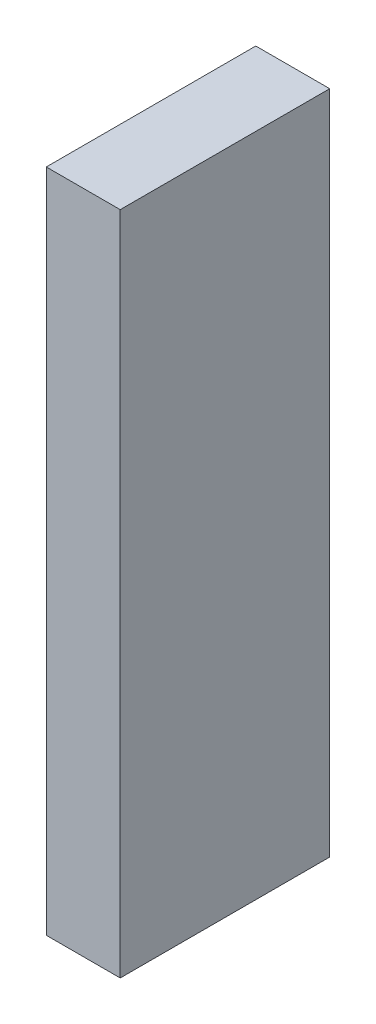
ISO-10303-21;
HEADER;
FILE_DESCRIPTION(('STEP AP214'),'2;1');
FILE_NAME('part.step','',(''),(''),'','','');
FILE_SCHEMA(('AUTOMOTIVE_DESIGN { 1 0 10303 214 1 1 1 1 }'));
ENDSEC;
DATA;
#1=APPLICATION_CONTEXT('core data for automotive mechanical design processes');
#2=APPLICATION_PROTOCOL_DEFINITION('international standard','automotive_design',2000,#1);
#3=PRODUCT_CONTEXT('',#1,'mechanical');
#4=PRODUCT('Part','Part','',(#3));
#5=PRODUCT_RELATED_PRODUCT_CATEGORY('part','',(#4));
#6=PRODUCT_DEFINITION_FORMATION('','',#4);
#7=PRODUCT_DEFINITION_CONTEXT('part definition',#1,'design');
#8=PRODUCT_DEFINITION('design','',#6,#7);
#9=PRODUCT_DEFINITION_SHAPE('','',#8);
#10=(LENGTH_UNIT() NAMED_UNIT(*) SI_UNIT(.MILLI.,.METRE.));
#11=(NAMED_UNIT(*) PLANE_ANGLE_UNIT() SI_UNIT($,.RADIAN.));
#12=(NAMED_UNIT(*) SI_UNIT($,.STERADIAN.) SOLID_ANGLE_UNIT());
#13=UNCERTAINTY_MEASURE_WITH_UNIT(LENGTH_MEASURE(1.E-05),#10,'distance_accuracy_value','');
#14=(GEOMETRIC_REPRESENTATION_CONTEXT(3) GLOBAL_UNCERTAINTY_ASSIGNED_CONTEXT((#13)) GLOBAL_UNIT_ASSIGNED_CONTEXT((#10,
#11,#12)) REPRESENTATION_CONTEXT('',''));
#15=CARTESIAN_POINT('',(0.,0.,0.));
#16=DIRECTION('',(0.,0.,1.));
#17=DIRECTION('',(1.,0.,0.));
#18=AXIS2_PLACEMENT_3D('',#15,#16,#17);
#19=CARTESIAN_POINT('',(2.44999769093604,2.69998244459617,0.));
#20=DIRECTION('',(-1.,1.19248806385031E-08,0.));
#21=DIRECTION('',(-1.19248806385031E-08,-1.,0.));
#22=AXIS2_PLACEMENT_3D('',#19,#20,#21);
#23=PLANE('',#22);
#24=DIRECTION('',(-1.19248806627069E-08,-1.,0.));
#25=VECTOR('',#24,1.);
#26=CARTESIAN_POINT('',(2.44999769093604,2.69998244459617,0.));
#27=LINE('',#26,#25);
#28=CARTESIAN_POINT('',(2.44999769093604,2.69998244459617,0.));
#29=VERTEX_POINT('',#28);
#30=CARTESIAN_POINT('',(2.44999762654175,-2.7000114518882,0.));
#31=VERTEX_POINT('',#30);
#32=EDGE_CURVE('E11',#29,#31,#27,.T.);
#33=ORIENTED_EDGE('',*,*,#32,.T.);
#34=DIRECTION('',(0.,0.,1.));
#35=VECTOR('',#34,1.);
#36=CARTESIAN_POINT('',(2.44999762654175,-2.7000114518882,0.));
#37=LINE('',#36,#35);
#38=CARTESIAN_POINT('',(2.44999762654175,-2.7000114518882,1.6999990940094));
#39=VERTEX_POINT('',#38);
#40=EDGE_CURVE('E88',#31,#39,#37,.T.);
#41=ORIENTED_EDGE('',*,*,#40,.T.);
#42=DIRECTION('',(-1.19248806627069E-08,-1.,0.));
#43=VECTOR('',#42,1.);
#44=CARTESIAN_POINT('',(2.44999769093604,2.69998244459617,1.6999990940094));
#45=LINE('',#44,#43);
#46=CARTESIAN_POINT('',(2.44999769093604,2.69998244459617,1.6999990940094));
#47=VERTEX_POINT('',#46);
#48=EDGE_CURVE('E83',#47,#39,#45,.T.);
#49=ORIENTED_EDGE('',*,*,#48,.F.);
#50=DIRECTION('',(0.,0.,1.));
#51=VECTOR('',#50,1.);
#52=CARTESIAN_POINT('',(2.44999769093604,2.69998244459619,0.));
#53=LINE('',#52,#51);
#54=EDGE_CURVE('E72',#29,#47,#53,.T.);
#55=ORIENTED_EDGE('',*,*,#54,.F.);
#56=EDGE_LOOP('',(#33,#41,#49,#55));
#57=FACE_BOUND('',#56,.T.);
#58=ADVANCED_FACE('F17',(#57),#23,.T.);
#59=CARTESIAN_POINT('',(2.44999762654175,-2.7000114518882,0.));
#60=DIRECTION('',(-1.19248806385031E-08,-1.,0.));
#61=DIRECTION('',(1.,-1.19248806385031E-08,0.));
#62=AXIS2_PLACEMENT_3D('',#59,#60,#61);
#63=PLANE('',#62);
#64=DIRECTION('',(1.,-1.1924880741852E-08,0.));
#65=VECTOR('',#64,1.);
#66=CARTESIAN_POINT('',(2.44999762654175,-2.7000114518882,0.));
#67=LINE('',#66,#65);
#68=CARTESIAN_POINT('',(3.04999991536011,-2.70001145904314,0.));
#69=VERTEX_POINT('',#68);
#70=EDGE_CURVE('E24',#31,#69,#67,.T.);
#71=ORIENTED_EDGE('',*,*,#70,.T.);
#72=DIRECTION('',(0.,0.,1.));
#73=VECTOR('',#72,1.);
#74=CARTESIAN_POINT('',(3.04999991536011,-2.70001145904316,0.));
#75=LINE('',#74,#73);
#76=CARTESIAN_POINT('',(3.04999991536011,-2.70001145904314,1.6999990940094));
#77=VERTEX_POINT('',#76);
#78=EDGE_CURVE('E85',#69,#77,#75,.T.);
#79=ORIENTED_EDGE('',*,*,#78,.T.);
#80=DIRECTION('',(1.,-1.1924880741852E-08,0.));
#81=VECTOR('',#80,1.);
#82=CARTESIAN_POINT('',(2.44999762654175,-2.7000114518882,1.6999990940094));
#83=LINE('',#82,#81);
#84=EDGE_CURVE('E66',#39,#77,#83,.T.);
#85=ORIENTED_EDGE('',*,*,#84,.F.);
#86=ORIENTED_EDGE('',*,*,#40,.F.);
#87=EDGE_LOOP('',(#71,#79,#85,#86));
#88=FACE_BOUND('',#87,.T.);
#89=ADVANCED_FACE('F89',(#88),#63,.T.);
#90=CARTESIAN_POINT('',(3.04999991536011,-2.70001145904314,0.));
#91=DIRECTION('',(1.,-1.19248806385031E-08,0.));
#92=DIRECTION('',(1.19248806385031E-08,1.,0.));
#93=AXIS2_PLACEMENT_3D('',#90,#91,#92);
#94=PLANE('',#93);
#95=DIRECTION('',(1.19248806627069E-08,1.,0.));
#96=VECTOR('',#95,1.);
#97=CARTESIAN_POINT('',(3.04999991536011,-2.70001145904314,0.));
#98=LINE('',#97,#96);
#99=CARTESIAN_POINT('',(3.0499999797544,2.69998243744124,0.));
#100=VERTEX_POINT('',#99);
#101=EDGE_CURVE('E62',#69,#100,#98,.T.);
#102=ORIENTED_EDGE('',*,*,#101,.T.);
#103=DIRECTION('',(0.,0.,1.));
#104=VECTOR('',#103,1.);
#105=CARTESIAN_POINT('',(3.04999997975439,2.69998243744124,0.));
#106=LINE('',#105,#104);
#107=CARTESIAN_POINT('',(3.0499999797544,2.69998243744124,1.6999990940094));
#108=VERTEX_POINT('',#107);
#109=EDGE_CURVE('E55',#100,#108,#106,.T.);
#110=ORIENTED_EDGE('',*,*,#109,.T.);
#111=DIRECTION('',(1.19248806627069E-08,1.,0.));
#112=VECTOR('',#111,1.);
#113=CARTESIAN_POINT('',(3.04999991536011,-2.70001145904314,1.6999990940094));
#114=LINE('',#113,#112);
#115=EDGE_CURVE('E59',#77,#108,#114,.T.);
#116=ORIENTED_EDGE('',*,*,#115,.F.);
#117=ORIENTED_EDGE('',*,*,#78,.F.);
#118=EDGE_LOOP('',(#102,#110,#116,#117));
#119=FACE_BOUND('',#118,.T.);
#120=ADVANCED_FACE('F57',(#119),#94,.T.);
#121=CARTESIAN_POINT('',(3.0499999797544,2.69998243744124,0.));
#122=DIRECTION('',(1.19248806385031E-08,1.,0.));
#123=DIRECTION('',(-1.,1.19248806385031E-08,0.));
#124=AXIS2_PLACEMENT_3D('',#121,#122,#123);
#125=PLANE('',#124);
#126=DIRECTION('',(-1.,1.1924880741852E-08,0.));
#127=VECTOR('',#126,1.);
#128=CARTESIAN_POINT('',(3.0499999797544,2.69998243744124,0.));
#129=LINE('',#128,#127);
#130=EDGE_CURVE('E65',#100,#29,#129,.T.);
#131=ORIENTED_EDGE('',*,*,#130,.T.);
#132=ORIENTED_EDGE('',*,*,#54,.T.);
#133=DIRECTION('',(-1.,1.1924880741852E-08,0.));
#134=VECTOR('',#133,1.);
#135=CARTESIAN_POINT('',(3.0499999797544,2.69998243744124,1.6999990940094));
#136=LINE('',#135,#134);
#137=EDGE_CURVE('E70',#108,#47,#136,.T.);
#138=ORIENTED_EDGE('',*,*,#137,.F.);
#139=ORIENTED_EDGE('',*,*,#109,.F.);
#140=EDGE_LOOP('',(#131,#132,#138,#139));
#141=FACE_BOUND('',#140,.T.);
#142=ADVANCED_FACE('F71',(#141),#125,.T.);
#143=CARTESIAN_POINT('',(65.7749938964844,-379.475006103516,1.6999990940094));
#144=DIRECTION('',(0.,0.,1.));
#145=DIRECTION('',(1.19248806385031E-08,1.,0.));
#146=AXIS2_PLACEMENT_3D('',#143,#144,#145);
#147=PLANE('',#146);
#148=ORIENTED_EDGE('',*,*,#48,.T.);
#149=ORIENTED_EDGE('',*,*,#84,.T.);
#150=ORIENTED_EDGE('',*,*,#115,.T.);
#151=ORIENTED_EDGE('',*,*,#137,.T.);
#152=EDGE_LOOP('',(#148,#149,#150,#151));
#153=FACE_BOUND('',#152,.T.);
#154=ADVANCED_FACE('F76',(#153),#147,.T.);
#155=CARTESIAN_POINT('',(65.7749938964844,-379.475006103516,0.));
#156=DIRECTION('',(0.,0.,1.));
#157=DIRECTION('',(1.19248806385031E-08,1.,0.));
#158=AXIS2_PLACEMENT_3D('',#155,#156,#157);
#159=PLANE('',#158);
#160=ORIENTED_EDGE('',*,*,#130,.F.);
#161=ORIENTED_EDGE('',*,*,#101,.F.);
#162=ORIENTED_EDGE('',*,*,#70,.F.);
#163=ORIENTED_EDGE('',*,*,#32,.F.);
#164=EDGE_LOOP('',(#160,#161,#162,#163));
#165=FACE_BOUND('',#164,.T.);
#166=ADVANCED_FACE('F91',(#165),#159,.F.);
#167=CLOSED_SHELL('',(#58,#89,#120,#142,#154,#166));
#168=MANIFOLD_SOLID_BREP('B1',#167);
#169=ADVANCED_BREP_SHAPE_REPRESENTATION('',(#18,#168),#14);
#170=SHAPE_DEFINITION_REPRESENTATION(#9,#169);
ENDSEC;
END-ISO-10303-21;
